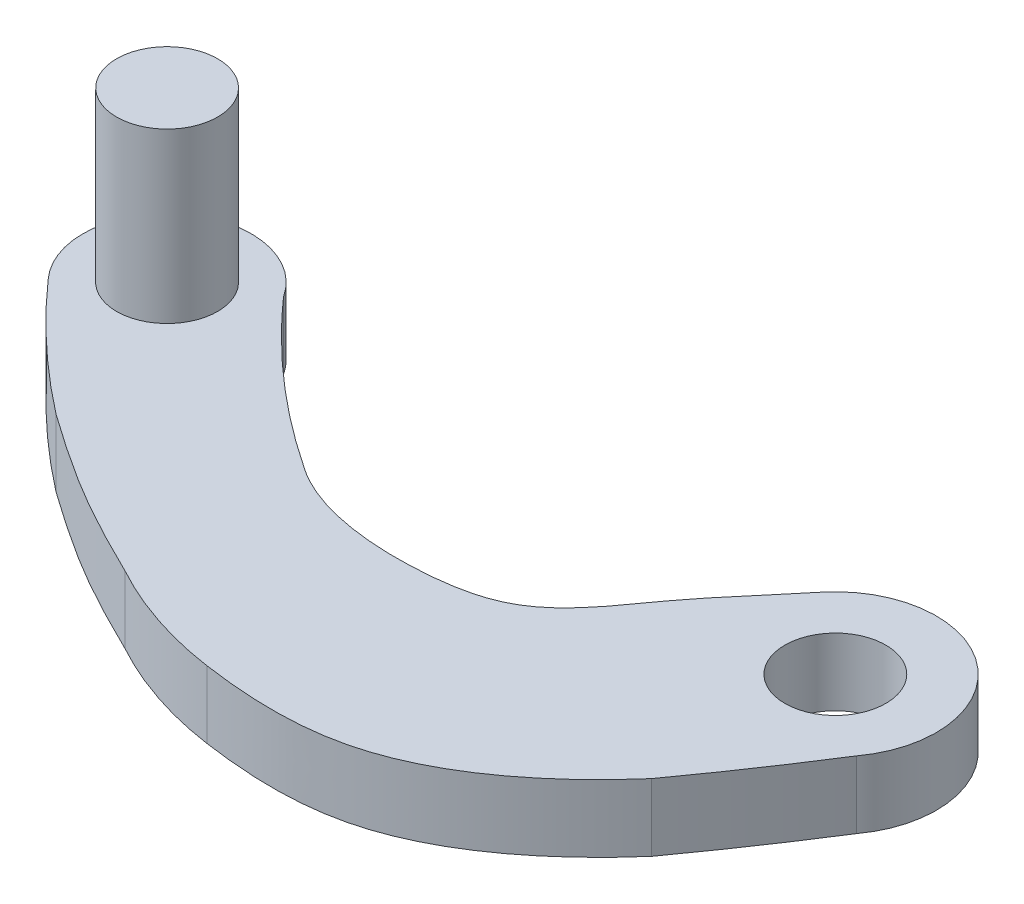
ISO-10303-21;
HEADER;
FILE_DESCRIPTION(('STEP AP214'),'2;1');
FILE_NAME('part.step','',(''),(''),'','','');
FILE_SCHEMA(('AUTOMOTIVE_DESIGN { 1 0 10303 214 1 1 1 1 }'));
ENDSEC;
DATA;
#1=APPLICATION_CONTEXT('core data for automotive mechanical design processes');
#2=APPLICATION_PROTOCOL_DEFINITION('international standard','automotive_design',2000,#1);
#3=PRODUCT_CONTEXT('',#1,'mechanical');
#4=PRODUCT('Part','Part','',(#3));
#5=PRODUCT_RELATED_PRODUCT_CATEGORY('part','',(#4));
#6=PRODUCT_DEFINITION_FORMATION('','',#4);
#7=PRODUCT_DEFINITION_CONTEXT('part definition',#1,'design');
#8=PRODUCT_DEFINITION('design','',#6,#7);
#9=PRODUCT_DEFINITION_SHAPE('','',#8);
#10=(LENGTH_UNIT() NAMED_UNIT(*) SI_UNIT(.MILLI.,.METRE.));
#11=(NAMED_UNIT(*) PLANE_ANGLE_UNIT() SI_UNIT($,.RADIAN.));
#12=(NAMED_UNIT(*) SI_UNIT($,.STERADIAN.) SOLID_ANGLE_UNIT());
#13=UNCERTAINTY_MEASURE_WITH_UNIT(LENGTH_MEASURE(1.E-05),#10,'distance_accuracy_value','');
#14=(GEOMETRIC_REPRESENTATION_CONTEXT(3) GLOBAL_UNCERTAINTY_ASSIGNED_CONTEXT((#13)) GLOBAL_UNIT_ASSIGNED_CONTEXT((#10,
#11,#12)) REPRESENTATION_CONTEXT('',''));
#15=CARTESIAN_POINT('',(0.,0.,0.));
#16=DIRECTION('',(0.,0.,1.));
#17=DIRECTION('',(1.,0.,0.));
#18=AXIS2_PLACEMENT_3D('',#15,#16,#17);
#19=CARTESIAN_POINT('',(-0.0475529433636825,2.,5.41433385987285));
#20=CARTESIAN_POINT('',(1.23977997883668,2.,3.63505288441227));
#21=CARTESIAN_POINT('',(2.41461031426765,2.,1.78035306336476));
#22=B_SPLINE_CURVE_WITH_KNOTS('',2,(#19,#20,#21),.UNSPECIFIED.,.F.,.F.,(3,3),(0.,1.),.UNSPECIFIED.);
#23=DIRECTION('',(0.,-1.,0.));
#24=VECTOR('',#23,1.);
#25=SURFACE_OF_LINEAR_EXTRUSION('',#22,#24);
#26=CARTESIAN_POINT('',(-0.0475529433636825,0.,5.41433385987285));
#27=CARTESIAN_POINT('',(1.23977997883668,0.,3.63505288441227));
#28=CARTESIAN_POINT('',(2.41461031426765,0.,1.78035306336476));
#29=B_SPLINE_CURVE_WITH_KNOTS('',2,(#26,#27,#28),.UNSPECIFIED.,.F.,.F.,(3,3),(0.,1.),.UNSPECIFIED.);
#30=CARTESIAN_POINT('',(-0.0475529433636825,0.,5.41433385987285));
#31=VERTEX_POINT('',#30);
#32=CARTESIAN_POINT('',(2.41461031426765,0.,1.78035306336476));
#33=VERTEX_POINT('',#32);
#34=EDGE_CURVE('E206',#31,#33,#29,.T.);
#35=ORIENTED_EDGE('',*,*,#34,.T.);
#36=DIRECTION('',(0.,-1.,0.));
#37=VECTOR('',#36,1.);
#38=CARTESIAN_POINT('',(2.41461031426765,2.,1.78035306336476));
#39=LINE('',#38,#37);
#40=CARTESIAN_POINT('',(2.41461031426765,2.,1.78035306336476));
#41=VERTEX_POINT('',#40);
#42=EDGE_CURVE('E11',#41,#33,#39,.T.);
#43=ORIENTED_EDGE('',*,*,#42,.F.);
#44=CARTESIAN_POINT('',(-0.0475529433636825,2.,5.41433385987285));
#45=VERTEX_POINT('',#44);
#46=EDGE_CURVE('E258',#45,#41,#22,.T.);
#47=ORIENTED_EDGE('',*,*,#46,.F.);
#48=DIRECTION('',(0.,-1.,0.));
#49=VECTOR('',#48,1.);
#50=CARTESIAN_POINT('',(-0.0475529433636825,2.,5.41433385987285));
#51=LINE('',#50,#49);
#52=EDGE_CURVE('E53',#45,#31,#51,.T.);
#53=ORIENTED_EDGE('',*,*,#52,.T.);
#54=EDGE_LOOP('',(#35,#43,#47,#53));
#55=FACE_BOUND('',#54,.T.);
#56=ADVANCED_FACE('F35',(#55),#25,.F.);
#57=CARTESIAN_POINT('',(0.,2.,0.));
#58=DIRECTION('',(0.,-1.,0.));
#59=DIRECTION('',(0.,0.,-1.));
#60=AXIS2_PLACEMENT_3D('',#57,#58,#59);
#61=CYLINDRICAL_SURFACE('',#60,3.);
#62=CARTESIAN_POINT('',(0.,0.,0.));
#63=DIRECTION('',(0.,1.,0.));
#64=DIRECTION('',(0.,0.,1.));
#65=AXIS2_PLACEMENT_3D('',#62,#63,#64);
#66=CIRCLE('',#65,3.);
#67=CARTESIAN_POINT('',(-2.33461482052512,0.,-1.88403122049091));
#68=VERTEX_POINT('',#67);
#69=EDGE_CURVE('E199',#33,#68,#66,.T.);
#70=ORIENTED_EDGE('',*,*,#69,.T.);
#71=DIRECTION('',(0.,-1.,0.));
#72=VECTOR('',#71,1.);
#73=CARTESIAN_POINT('',(-2.33461482052512,2.,-1.88403122049091));
#74=LINE('',#73,#72);
#75=CARTESIAN_POINT('',(-2.33461482052512,2.,-1.88403122049091));
#76=VERTEX_POINT('',#75);
#77=EDGE_CURVE('E45',#76,#68,#74,.T.);
#78=ORIENTED_EDGE('',*,*,#77,.F.);
#79=CARTESIAN_POINT('',(0.,2.,0.));
#80=DIRECTION('',(0.,1.,0.));
#81=DIRECTION('',(0.,0.,1.));
#82=AXIS2_PLACEMENT_3D('',#79,#80,#81);
#83=CIRCLE('',#82,3.);
#84=EDGE_CURVE('E94',#41,#76,#83,.T.);
#85=ORIENTED_EDGE('',*,*,#84,.F.);
#86=ORIENTED_EDGE('',*,*,#42,.T.);
#87=EDGE_LOOP('',(#70,#78,#85,#86));
#88=FACE_BOUND('',#87,.T.);
#89=ADVANCED_FACE('F193',(#88),#61,.T.);
#90=CARTESIAN_POINT('',(-2.33461482052512,2.,-1.88403122049091));
#91=CARTESIAN_POINT('',(-2.95132525937757,2.,-1.11982874079828));
#92=CARTESIAN_POINT('',(-4.50929911754079,2.,0.563300274902011));
#93=CARTESIAN_POINT('',(-5.98836609822568,2.,3.12131217457653));
#94=CARTESIAN_POINT('',(-9.77732423251604,2.,3.72498405030082));
#95=CARTESIAN_POINT('',(-12.1084754677315,2.,3.34911662574199));
#96=CARTESIAN_POINT('',(-13.2054111786459,2.,2.5694145199217));
#97=B_SPLINE_CURVE_WITH_KNOTS('',3,(#90,#91,#92,#93,#94,#95,#96),.UNSPECIFIED.,.F.,.F.,(4,1,1,1,
4),(0.,0.210355784551184,0.457410567933181,0.578047142069881,0.870899614871136),.UNSPECIFIED.);
#98=DIRECTION('',(0.,-1.,0.));
#99=VECTOR('',#98,1.);
#100=SURFACE_OF_LINEAR_EXTRUSION('',#97,#99);
#101=CARTESIAN_POINT('',(-2.33461482052512,0.,-1.88403122049091));
#102=CARTESIAN_POINT('',(-2.95132525937757,0.,-1.11982874079828));
#103=CARTESIAN_POINT('',(-4.50929911754079,0.,0.563300274902011));
#104=CARTESIAN_POINT('',(-5.98836609822568,0.,3.12131217457653));
#105=CARTESIAN_POINT('',(-9.77732423251604,0.,3.72498405030082));
#106=CARTESIAN_POINT('',(-12.1084754677315,0.,3.34911662574199));
#107=CARTESIAN_POINT('',(-13.2054111786459,0.,2.5694145199217));
#108=B_SPLINE_CURVE_WITH_KNOTS('',3,(#101,#102,#103,#104,#105,#106,#107),.UNSPECIFIED.,.F.,.F.,
(4,1,1,1,4),(0.,0.210355784551184,0.457410567933181,0.578047142069881,0.870899614871136),.UNSPECIFIED.);
#109=CARTESIAN_POINT('',(-13.2054111786459,0.,2.5694145199217));
#110=VERTEX_POINT('',#109);
#111=EDGE_CURVE('E205',#68,#110,#108,.T.);
#112=ORIENTED_EDGE('',*,*,#111,.T.);
#113=DIRECTION('',(0.,-1.,0.));
#114=VECTOR('',#113,1.);
#115=CARTESIAN_POINT('',(-13.2054111786459,2.,2.5694145199217));
#116=LINE('',#115,#114);
#117=CARTESIAN_POINT('',(-13.2054111786459,2.,2.5694145199217));
#118=VERTEX_POINT('',#117);
#119=EDGE_CURVE('E210',#118,#110,#116,.T.);
#120=ORIENTED_EDGE('',*,*,#119,.F.);
#121=EDGE_CURVE('E179',#76,#118,#97,.T.);
#122=ORIENTED_EDGE('',*,*,#121,.F.);
#123=ORIENTED_EDGE('',*,*,#77,.T.);
#124=EDGE_LOOP('',(#112,#120,#122,#123));
#125=FACE_BOUND('',#124,.T.);
#126=ADVANCED_FACE('F190',(#125),#100,.F.);
#127=CARTESIAN_POINT('',(-13.2054111786459,2.,2.5694145199217));
#128=CARTESIAN_POINT('',(-15.8193521094545,2.,0.833752710023343));
#129=CARTESIAN_POINT('',(-17.8973430329791,2.,-1.5110586144937));
#130=B_SPLINE_CURVE_WITH_KNOTS('',2,(#127,#128,#129),.UNSPECIFIED.,.F.,.F.,(3,3),(0.,1.),.UNSPECIFIED.);
#131=DIRECTION('',(0.,-1.,0.));
#132=VECTOR('',#131,1.);
#133=SURFACE_OF_LINEAR_EXTRUSION('',#130,#132);
#134=CARTESIAN_POINT('',(-13.2054111786459,0.,2.5694145199217));
#135=CARTESIAN_POINT('',(-15.8193521094545,0.,0.833752710023343));
#136=CARTESIAN_POINT('',(-17.8973430329791,0.,-1.5110586144937));
#137=B_SPLINE_CURVE_WITH_KNOTS('',2,(#134,#135,#136),.UNSPECIFIED.,.F.,.F.,(3,3),(0.,1.),.UNSPECIFIED.);
#138=CARTESIAN_POINT('',(-17.8973430329791,0.,-1.5110586144937));
#139=VERTEX_POINT('',#138);
#140=EDGE_CURVE('E215',#110,#139,#137,.T.);
#141=ORIENTED_EDGE('',*,*,#140,.T.);
#142=DIRECTION('',(0.,-1.,0.));
#143=VECTOR('',#142,1.);
#144=CARTESIAN_POINT('',(-17.8973430329791,2.,-1.5110586144937));
#145=LINE('',#144,#143);
#146=CARTESIAN_POINT('',(-17.8973430329791,2.,-1.5110586144937));
#147=VERTEX_POINT('',#146);
#148=EDGE_CURVE('E267',#147,#139,#145,.T.);
#149=ORIENTED_EDGE('',*,*,#148,.F.);
#150=EDGE_CURVE('E174',#118,#147,#130,.T.);
#151=ORIENTED_EDGE('',*,*,#150,.F.);
#152=ORIENTED_EDGE('',*,*,#119,.T.);
#153=EDGE_LOOP('',(#141,#149,#151,#152));
#154=FACE_BOUND('',#153,.T.);
#155=ADVANCED_FACE('F187',(#154),#133,.F.);
#156=CARTESIAN_POINT('',(-19.9993778792042,2.,-0.157748042135916));
#157=DIRECTION('',(0.,-1.,0.));
#158=DIRECTION('',(0.,0.,-1.));
#159=AXIS2_PLACEMENT_3D('',#156,#157,#158);
#160=CYLINDRICAL_SURFACE('',#159,2.5);
#161=CARTESIAN_POINT('',(-19.9993778792042,0.,-0.157748042135916));
#162=DIRECTION('',(0.,1.,0.));
#163=DIRECTION('',(0.,0.,1.));
#164=AXIS2_PLACEMENT_3D('',#161,#162,#163);
#165=CIRCLE('',#164,2.5);
#166=CARTESIAN_POINT('',(-21.8390415134287,0.,1.53507141454333));
#167=VERTEX_POINT('',#166);
#168=EDGE_CURVE('E217',#139,#167,#165,.T.);
#169=ORIENTED_EDGE('',*,*,#168,.T.);
#170=DIRECTION('',(0.,-1.,0.));
#171=VECTOR('',#170,1.);
#172=CARTESIAN_POINT('',(-21.8390415134287,2.,1.53507141454333));
#173=LINE('',#172,#171);
#174=CARTESIAN_POINT('',(-21.8390415134287,2.,1.53507141454333));
#175=VERTEX_POINT('',#174);
#176=EDGE_CURVE('E265',#175,#167,#173,.T.);
#177=ORIENTED_EDGE('',*,*,#176,.F.);
#178=CARTESIAN_POINT('',(-19.9993778792042,2.,-0.157748042135916));
#179=DIRECTION('',(0.,1.,0.));
#180=DIRECTION('',(0.,0.,1.));
#181=AXIS2_PLACEMENT_3D('',#178,#179,#180);
#182=CIRCLE('',#181,2.5);
#183=EDGE_CURVE('E169',#147,#175,#182,.T.);
#184=ORIENTED_EDGE('',*,*,#183,.F.);
#185=ORIENTED_EDGE('',*,*,#148,.T.);
#186=EDGE_LOOP('',(#169,#177,#184,#185));
#187=FACE_BOUND('',#186,.T.);
#188=ADVANCED_FACE('F162',(#187),#160,.T.);
#189=CARTESIAN_POINT('',(-18.2577127867675,2.,4.88196622315545));
#190=CARTESIAN_POINT('',(-20.2060955906272,2.,3.37696590083292));
#191=CARTESIAN_POINT('',(-21.8390415134287,2.,1.53507141454333));
#192=B_SPLINE_CURVE_WITH_KNOTS('',2,(#189,#190,#191),.UNSPECIFIED.,.F.,.F.,(3,3),(0.,1.),.UNSPECIFIED.);
#193=DIRECTION('',(0.,-1.,0.));
#194=VECTOR('',#193,1.);
#195=SURFACE_OF_LINEAR_EXTRUSION('',#192,#194);
#196=CARTESIAN_POINT('',(-18.2577127867675,0.,4.88196622315545));
#197=CARTESIAN_POINT('',(-20.2060955906272,0.,3.37696590083292));
#198=CARTESIAN_POINT('',(-21.8390415134287,0.,1.53507141454333));
#199=B_SPLINE_CURVE_WITH_KNOTS('',2,(#196,#197,#198),.UNSPECIFIED.,.F.,.F.,(3,3),(0.,1.),.UNSPECIFIED.);
#200=CARTESIAN_POINT('',(-18.2577127867675,0.,4.88196622315545));
#201=VERTEX_POINT('',#200);
#202=EDGE_CURVE('E232',#201,#167,#199,.T.);
#203=ORIENTED_EDGE('',*,*,#202,.F.);
#204=DIRECTION('',(0.,-1.,0.));
#205=VECTOR('',#204,1.);
#206=CARTESIAN_POINT('',(-18.2577127867675,2.,4.88196622315545));
#207=LINE('',#206,#205);
#208=CARTESIAN_POINT('',(-18.2577127867675,2.,4.88196622315545));
#209=VERTEX_POINT('',#208);
#210=EDGE_CURVE('E122',#209,#201,#207,.T.);
#211=ORIENTED_EDGE('',*,*,#210,.F.);
#212=EDGE_CURVE('E131',#209,#175,#192,.T.);
#213=ORIENTED_EDGE('',*,*,#212,.T.);
#214=ORIENTED_EDGE('',*,*,#176,.T.);
#215=EDGE_LOOP('',(#203,#211,#213,#214));
#216=FACE_BOUND('',#215,.T.);
#217=ADVANCED_FACE('F159',(#216),#195,.T.);
#218=CARTESIAN_POINT('',(-13.2054111786459,2.,7.88653260834391));
#219=CARTESIAN_POINT('',(-14.0542658366058,2.,7.47183124356071));
#220=CARTESIAN_POINT('',(-15.8067382639916,2.,6.58092277808278));
#221=CARTESIAN_POINT('',(-17.4288567716721,2.,5.46959428640393));
#222=CARTESIAN_POINT('',(-18.2577127867675,2.,4.88196622315545));
#223=B_SPLINE_CURVE_WITH_KNOTS('',3,(#218,#219,#220,#221,#222),.UNSPECIFIED.,.F.,.F.,(4,1,4),
(0.,0.481848673191408,1.),.UNSPECIFIED.);
#224=DIRECTION('',(0.,-1.,0.));
#225=VECTOR('',#224,1.);
#226=SURFACE_OF_LINEAR_EXTRUSION('',#223,#225);
#227=CARTESIAN_POINT('',(-13.2054111786459,0.,7.88653260834391));
#228=CARTESIAN_POINT('',(-14.0542658366058,0.,7.47183124356071));
#229=CARTESIAN_POINT('',(-15.8067382639916,0.,6.58092277808278));
#230=CARTESIAN_POINT('',(-17.4288567716721,0.,5.46959428640393));
#231=CARTESIAN_POINT('',(-18.2577127867675,0.,4.88196622315545));
#232=B_SPLINE_CURVE_WITH_KNOTS('',3,(#227,#228,#229,#230,#231),.UNSPECIFIED.,.F.,.F.,(4,1,4),
(0.,0.481848673191408,1.),.UNSPECIFIED.);
#233=CARTESIAN_POINT('',(-13.2054111786459,0.,7.88653260834391));
#234=VERTEX_POINT('',#233);
#235=EDGE_CURVE('E118',#234,#201,#232,.T.);
#236=ORIENTED_EDGE('',*,*,#235,.F.);
#237=DIRECTION('',(0.,-1.,0.));
#238=VECTOR('',#237,1.);
#239=CARTESIAN_POINT('',(-13.2054111786459,2.,7.88653260834391));
#240=LINE('',#239,#238);
#241=CARTESIAN_POINT('',(-13.2054111786459,2.,7.88653260834391));
#242=VERTEX_POINT('',#241);
#243=EDGE_CURVE('E113',#242,#234,#240,.T.);
#244=ORIENTED_EDGE('',*,*,#243,.F.);
#245=EDGE_CURVE('E116',#242,#209,#223,.T.);
#246=ORIENTED_EDGE('',*,*,#245,.T.);
#247=ORIENTED_EDGE('',*,*,#210,.T.);
#248=EDGE_LOOP('',(#236,#244,#246,#247));
#249=FACE_BOUND('',#248,.T.);
#250=ADVANCED_FACE('F115',(#249),#226,.T.);
#251=CARTESIAN_POINT('',(-9.55493666807367,2.,9.10902108238721));
#252=CARTESIAN_POINT('',(-11.4806065248772,2.,8.82957167955213));
#253=CARTESIAN_POINT('',(-13.2054111786459,2.,7.88653260834391));
#254=B_SPLINE_CURVE_WITH_KNOTS('',2,(#251,#252,#253),.UNSPECIFIED.,.F.,.F.,(3,3),(0.,1.),.UNSPECIFIED.);
#255=DIRECTION('',(0.,-1.,0.));
#256=VECTOR('',#255,1.);
#257=SURFACE_OF_LINEAR_EXTRUSION('',#254,#256);
#258=CARTESIAN_POINT('',(-9.55493666807367,0.,9.10902108238721));
#259=CARTESIAN_POINT('',(-11.4806065248772,0.,8.82957167955213));
#260=CARTESIAN_POINT('',(-13.2054111786459,0.,7.88653260834391));
#261=B_SPLINE_CURVE_WITH_KNOTS('',2,(#258,#259,#260),.UNSPECIFIED.,.F.,.F.,(3,3),(0.,1.),.UNSPECIFIED.);
#262=CARTESIAN_POINT('',(-9.55493666807367,0.,9.10902108238721));
#263=VERTEX_POINT('',#262);
#264=EDGE_CURVE('E243',#263,#234,#261,.T.);
#265=ORIENTED_EDGE('',*,*,#264,.F.);
#266=DIRECTION('',(0.,-1.,0.));
#267=VECTOR('',#266,1.);
#268=CARTESIAN_POINT('',(-9.55493666807367,2.,9.10902108238721));
#269=LINE('',#268,#267);
#270=CARTESIAN_POINT('',(-9.55493666807367,2.,9.10902108238721));
#271=VERTEX_POINT('',#270);
#272=EDGE_CURVE('E82',#271,#263,#269,.T.);
#273=ORIENTED_EDGE('',*,*,#272,.F.);
#274=EDGE_CURVE('E129',#271,#242,#254,.T.);
#275=ORIENTED_EDGE('',*,*,#274,.T.);
#276=ORIENTED_EDGE('',*,*,#243,.T.);
#277=EDGE_LOOP('',(#265,#273,#275,#276));
#278=FACE_BOUND('',#277,.T.);
#279=ADVANCED_FACE('F133',(#278),#257,.T.);
#280=CARTESIAN_POINT('',(-0.0475529433636825,2.,5.41433385987285));
#281=CARTESIAN_POINT('',(-1.43699541456564,2.,7.00804447166291));
#282=CARTESIAN_POINT('',(-4.46755784088869,2.,9.49500411050694));
#283=CARTESIAN_POINT('',(-8.18890266230341,2.,9.30639559105635));
#284=CARTESIAN_POINT('',(-9.55493666807367,2.,9.10902108238721));
#285=B_SPLINE_CURVE_WITH_KNOTS('',3,(#280,#281,#282,#283,#284),.UNSPECIFIED.,.F.,.F.,(4,1,4),
(0.,0.608220396552407,1.),.UNSPECIFIED.);
#286=DIRECTION('',(0.,-1.,0.));
#287=VECTOR('',#286,1.);
#288=SURFACE_OF_LINEAR_EXTRUSION('',#285,#287);
#289=CARTESIAN_POINT('',(-0.0475529433636825,0.,5.41433385987285));
#290=CARTESIAN_POINT('',(-1.43699541456564,0.,7.00804447166291));
#291=CARTESIAN_POINT('',(-4.46755784088869,0.,9.49500411050694));
#292=CARTESIAN_POINT('',(-8.18890266230341,0.,9.30639559105635));
#293=CARTESIAN_POINT('',(-9.55493666807367,0.,9.10902108238721));
#294=B_SPLINE_CURVE_WITH_KNOTS('',3,(#289,#290,#291,#292,#293),.UNSPECIFIED.,.F.,.F.,(4,1,4),
(0.,0.608220396552407,1.),.UNSPECIFIED.);
#295=EDGE_CURVE('E250',#31,#263,#294,.T.);
#296=ORIENTED_EDGE('',*,*,#295,.F.);
#297=ORIENTED_EDGE('',*,*,#52,.F.);
#298=EDGE_CURVE('E134',#45,#271,#285,.T.);
#299=ORIENTED_EDGE('',*,*,#298,.T.);
#300=ORIENTED_EDGE('',*,*,#272,.T.);
#301=EDGE_LOOP('',(#296,#297,#299,#300));
#302=FACE_BOUND('',#301,.T.);
#303=ADVANCED_FACE('F155',(#302),#288,.T.);
#304=CARTESIAN_POINT('',(0.,2.,0.));
#305=DIRECTION('',(0.,1.,0.));
#306=DIRECTION('',(0.,0.,1.));
#307=AXIS2_PLACEMENT_3D('',#304,#305,#306);
#308=PLANE('',#307);
#309=CARTESIAN_POINT('',(-19.9993778792042,2.,-0.157748042135916));
#310=DIRECTION('',(0.,1.,0.));
#311=DIRECTION('',(0.,0.,1.));
#312=AXIS2_PLACEMENT_3D('',#309,#310,#311);
#313=CIRCLE('',#312,1.5);
#314=CARTESIAN_POINT('',(-19.9993778792042,2.,1.34225195786408));
#315=VERTEX_POINT('',#314);
#316=EDGE_CURVE('E285',#315,#315,#313,.T.);
#317=ORIENTED_EDGE('',*,*,#316,.F.);
#318=EDGE_LOOP('',(#317));
#319=FACE_BOUND('',#318,.T.);
#320=CARTESIAN_POINT('',(0.,2.,0.));
#321=DIRECTION('',(0.,1.,0.));
#322=DIRECTION('',(0.,0.,1.));
#323=AXIS2_PLACEMENT_3D('',#320,#321,#322);
#324=CIRCLE('',#323,1.5);
#325=CARTESIAN_POINT('',(0.,2.,1.5));
#326=VERTEX_POINT('',#325);
#327=EDGE_CURVE('E278',#326,#326,#324,.T.);
#328=ORIENTED_EDGE('',*,*,#327,.F.);
#329=EDGE_LOOP('',(#328));
#330=FACE_BOUND('',#329,.T.);
#331=ORIENTED_EDGE('',*,*,#46,.T.);
#332=ORIENTED_EDGE('',*,*,#84,.T.);
#333=ORIENTED_EDGE('',*,*,#121,.T.);
#334=ORIENTED_EDGE('',*,*,#150,.T.);
#335=ORIENTED_EDGE('',*,*,#183,.T.);
#336=ORIENTED_EDGE('',*,*,#212,.F.);
#337=ORIENTED_EDGE('',*,*,#245,.F.);
#338=ORIENTED_EDGE('',*,*,#274,.F.);
#339=ORIENTED_EDGE('',*,*,#298,.F.);
#340=EDGE_LOOP('',(#331,#332,#333,#334,#335,#336,#337,#338,#339));
#341=FACE_BOUND('',#340,.T.);
#342=ADVANCED_FACE('F127',(#319,#330,#341),#308,.T.);
#343=CARTESIAN_POINT('',(0.,0.,0.));
#344=DIRECTION('',(0.,1.,0.));
#345=DIRECTION('',(0.,0.,1.));
#346=AXIS2_PLACEMENT_3D('',#343,#344,#345);
#347=PLANE('',#346);
#348=CARTESIAN_POINT('',(0.,0.,0.));
#349=DIRECTION('',(0.,1.,0.));
#350=DIRECTION('',(0.,0.,1.));
#351=AXIS2_PLACEMENT_3D('',#348,#349,#350);
#352=CIRCLE('',#351,1.5);
#353=CARTESIAN_POINT('',(0.,0.,1.5));
#354=VERTEX_POINT('',#353);
#355=EDGE_CURVE('E39',#354,#354,#352,.T.);
#356=ORIENTED_EDGE('',*,*,#355,.T.);
#357=EDGE_LOOP('',(#356));
#358=FACE_BOUND('',#357,.T.);
#359=ORIENTED_EDGE('',*,*,#34,.F.);
#360=ORIENTED_EDGE('',*,*,#295,.T.);
#361=ORIENTED_EDGE('',*,*,#264,.T.);
#362=ORIENTED_EDGE('',*,*,#235,.T.);
#363=ORIENTED_EDGE('',*,*,#202,.T.);
#364=ORIENTED_EDGE('',*,*,#168,.F.);
#365=ORIENTED_EDGE('',*,*,#140,.F.);
#366=ORIENTED_EDGE('',*,*,#111,.F.);
#367=ORIENTED_EDGE('',*,*,#69,.F.);
#368=EDGE_LOOP('',(#359,#360,#361,#362,#363,#364,#365,#366,#367));
#369=FACE_BOUND('',#368,.T.);
#370=ADVANCED_FACE('F213',(#358,#369),#347,.F.);
#371=CARTESIAN_POINT('',(0.,-1.,0.));
#372=DIRECTION('',(0.,1.,0.));
#373=DIRECTION('',(0.,0.,1.));
#374=AXIS2_PLACEMENT_3D('',#371,#372,#373);
#375=CYLINDRICAL_SURFACE('',#374,1.5);
#376=ORIENTED_EDGE('',*,*,#327,.T.);
#377=EDGE_LOOP('',(#376));
#378=FACE_BOUND('',#377,.T.);
#379=ORIENTED_EDGE('',*,*,#355,.F.);
#380=EDGE_LOOP('',(#379));
#381=FACE_BOUND('',#380,.T.);
#382=ADVANCED_FACE('F296',(#378,#381),#375,.F.);
#383=CARTESIAN_POINT('',(-19.9993778792042,7.,-0.157748042135916));
#384=DIRECTION('',(0.,-1.,0.));
#385=DIRECTION('',(0.,0.,-1.));
#386=AXIS2_PLACEMENT_3D('',#383,#384,#385);
#387=CYLINDRICAL_SURFACE('',#386,1.5);
#388=CARTESIAN_POINT('',(-19.9993778792042,7.,-0.157748042135916));
#389=DIRECTION('',(0.,1.,0.));
#390=DIRECTION('',(0.,0.,1.));
#391=AXIS2_PLACEMENT_3D('',#388,#389,#390);
#392=CIRCLE('',#391,1.5);
#393=CARTESIAN_POINT('',(-19.9993778792042,7.,1.34225195786408));
#394=VERTEX_POINT('',#393);
#395=EDGE_CURVE('E284',#394,#394,#392,.T.);
#396=ORIENTED_EDGE('',*,*,#395,.F.);
#397=EDGE_LOOP('',(#396));
#398=FACE_BOUND('',#397,.T.);
#399=ORIENTED_EDGE('',*,*,#316,.T.);
#400=EDGE_LOOP('',(#399));
#401=FACE_BOUND('',#400,.T.);
#402=ADVANCED_FACE('F293',(#398,#401),#387,.T.);
#403=CARTESIAN_POINT('',(-19.9993778792042,7.,-0.157748042135916));
#404=DIRECTION('',(0.,1.,0.));
#405=DIRECTION('',(0.,0.,1.));
#406=AXIS2_PLACEMENT_3D('',#403,#404,#405);
#407=PLANE('',#406);
#408=ORIENTED_EDGE('',*,*,#395,.T.);
#409=EDGE_LOOP('',(#408));
#410=FACE_BOUND('',#409,.T.);
#411=ADVANCED_FACE('F291',(#410),#407,.T.);
#412=CLOSED_SHELL('',(#56,#89,#126,#155,#188,#217,#250,#279,#303,#342,#370,#382,#402,#411));
#413=MANIFOLD_SOLID_BREP('B2',#412);
#414=ADVANCED_BREP_SHAPE_REPRESENTATION('',(#18,#413),#14);
#415=SHAPE_DEFINITION_REPRESENTATION(#9,#414);
ENDSEC;
END-ISO-10303-21;
